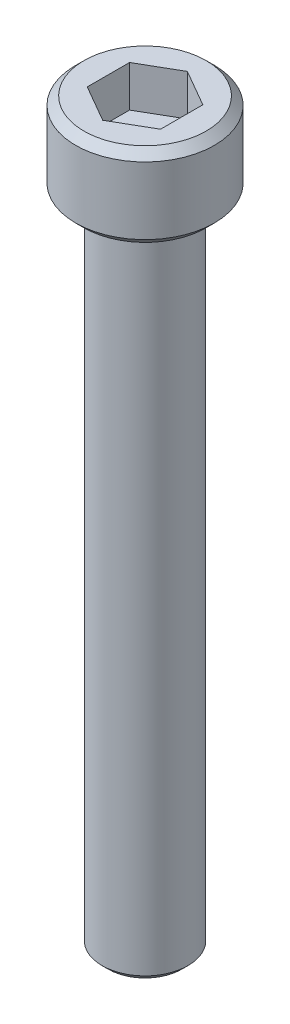
ISO-10303-21;
HEADER;
FILE_DESCRIPTION(('STEP AP214'),'2;1');
FILE_NAME('part.step','',(''),(''),'','','');
FILE_SCHEMA(('AUTOMOTIVE_DESIGN { 1 0 10303 214 1 1 1 1 }'));
ENDSEC;
DATA;
#1=APPLICATION_CONTEXT('core data for automotive mechanical design processes');
#2=APPLICATION_PROTOCOL_DEFINITION('international standard','automotive_design',2000,#1);
#3=PRODUCT_CONTEXT('',#1,'mechanical');
#4=PRODUCT('Part','Part','',(#3));
#5=PRODUCT_RELATED_PRODUCT_CATEGORY('part','',(#4));
#6=PRODUCT_DEFINITION_FORMATION('','',#4);
#7=PRODUCT_DEFINITION_CONTEXT('part definition',#1,'design');
#8=PRODUCT_DEFINITION('design','',#6,#7);
#9=PRODUCT_DEFINITION_SHAPE('','',#8);
#10=(LENGTH_UNIT() NAMED_UNIT(*) SI_UNIT(.MILLI.,.METRE.));
#11=(NAMED_UNIT(*) PLANE_ANGLE_UNIT() SI_UNIT($,.RADIAN.));
#12=(NAMED_UNIT(*) SI_UNIT($,.STERADIAN.) SOLID_ANGLE_UNIT());
#13=UNCERTAINTY_MEASURE_WITH_UNIT(LENGTH_MEASURE(1.E-05),#10,'distance_accuracy_value','');
#14=(GEOMETRIC_REPRESENTATION_CONTEXT(3) GLOBAL_UNCERTAINTY_ASSIGNED_CONTEXT((#13)) GLOBAL_UNIT_ASSIGNED_CONTEXT((#10,
#11,#12)) REPRESENTATION_CONTEXT('',''));
#15=CARTESIAN_POINT('',(0.,0.,0.));
#16=DIRECTION('',(0.,0.,1.));
#17=DIRECTION('',(1.,0.,0.));
#18=AXIS2_PLACEMENT_3D('',#15,#16,#17);
#19=CARTESIAN_POINT('',(1.77799999999999,2.064,3.07958633585744));
#20=DIRECTION('',(0.,1.,0.));
#21=DIRECTION('',(-1.,0.,0.));
#22=AXIS2_PLACEMENT_3D('',#19,#20,#21);
#23=PLANE('',#22);
#24=DIRECTION('',(-0.866025403784438,0.,0.5));
#25=VECTOR('',#24,1.);
#26=CARTESIAN_POINT('',(0.,2.064,-2.05305755723831));
#27=LINE('',#26,#25);
#28=CARTESIAN_POINT('',(0.,2.064,-2.05305755723831));
#29=VERTEX_POINT('',#28);
#30=CARTESIAN_POINT('',(-1.778,2.064,-1.02652877861915));
#31=VERTEX_POINT('',#30);
#32=EDGE_CURVE('E67',#29,#31,#27,.T.);
#33=ORIENTED_EDGE('',*,*,#32,.T.);
#34=DIRECTION('',(0.,0.,1.));
#35=VECTOR('',#34,1.);
#36=CARTESIAN_POINT('',(-1.778,2.064,-1.02652877861915));
#37=LINE('',#36,#35);
#38=CARTESIAN_POINT('',(-1.778,2.064,1.02652877861915));
#39=VERTEX_POINT('',#38);
#40=EDGE_CURVE('E69',#31,#39,#37,.T.);
#41=ORIENTED_EDGE('',*,*,#40,.T.);
#42=DIRECTION('',(0.866025403784439,0.,0.5));
#43=VECTOR('',#42,1.);
#44=CARTESIAN_POINT('',(-1.778,2.064,1.02652877861915));
#45=LINE('',#44,#43);
#46=CARTESIAN_POINT('',(0.,2.064,2.05305755723829));
#47=VERTEX_POINT('',#46);
#48=EDGE_CURVE('E71',#39,#47,#45,.T.);
#49=ORIENTED_EDGE('',*,*,#48,.T.);
#50=DIRECTION('',(0.866025403784438,0.,-0.500000000000001));
#51=VECTOR('',#50,1.);
#52=CARTESIAN_POINT('',(0.,2.064,2.05305755723828));
#53=LINE('',#52,#51);
#54=CARTESIAN_POINT('',(1.77799999999999,2.064,1.02652877861912));
#55=VERTEX_POINT('',#54);
#56=EDGE_CURVE('E126',#47,#55,#53,.T.);
#57=ORIENTED_EDGE('',*,*,#56,.T.);
#58=DIRECTION('',(0.,0.,1.));
#59=VECTOR('',#58,1.);
#60=CARTESIAN_POINT('',(1.77799999999999,2.064,1.02652877861912));
#61=LINE('',#60,#59);
#62=CARTESIAN_POINT('',(1.77799999999999,2.064,-1.02652877861916));
#63=VERTEX_POINT('',#62);
#64=EDGE_CURVE('E131',#55,#63,#61,.F.);
#65=ORIENTED_EDGE('',*,*,#64,.T.);
#66=DIRECTION('',(-0.866025403784439,0.,-0.5));
#67=VECTOR('',#66,1.);
#68=CARTESIAN_POINT('',(1.778,2.064,-1.02652877861916));
#69=LINE('',#68,#67);
#70=EDGE_CURVE('E135',#63,#29,#69,.T.);
#71=ORIENTED_EDGE('',*,*,#70,.T.);
#72=EDGE_LOOP('',(#33,#41,#49,#57,#65,#71));
#73=FACE_BOUND('',#72,.T.);
#74=ADVANCED_FACE('F16',(#73),#23,.T.);
#75=CARTESIAN_POINT('',(-1.778,2.064,1.02652877861915));
#76=DIRECTION('',(-0.5,0.,0.866025403784439));
#77=DIRECTION('',(0.866025403784439,0.,0.5));
#78=AXIS2_PLACEMENT_3D('',#75,#76,#77);
#79=PLANE('',#78);
#80=DIRECTION('',(0.,1.,0.));
#81=VECTOR('',#80,1.);
#82=CARTESIAN_POINT('',(0.,2.064,2.05305755723828));
#83=LINE('',#82,#81);
#84=CARTESIAN_POINT('',(0.,4.064,2.05305755723829));
#85=VERTEX_POINT('',#84);
#86=EDGE_CURVE('E82',#85,#47,#83,.F.);
#87=ORIENTED_EDGE('',*,*,#86,.T.);
#88=ORIENTED_EDGE('',*,*,#48,.F.);
#89=DIRECTION('',(0.,1.,0.));
#90=VECTOR('',#89,1.);
#91=CARTESIAN_POINT('',(-1.778,2.064,1.02652877861915));
#92=LINE('',#91,#90);
#93=CARTESIAN_POINT('',(-1.778,4.064,1.02652877861915));
#94=VERTEX_POINT('',#93);
#95=EDGE_CURVE('E76',#39,#94,#92,.T.);
#96=ORIENTED_EDGE('',*,*,#95,.T.);
#97=DIRECTION('',(-0.866025403784443,0.,-0.499999999999993));
#98=VECTOR('',#97,1.);
#99=CARTESIAN_POINT('',(0.,4.064,2.05305755723828));
#100=LINE('',#99,#98);
#101=EDGE_CURVE('E123',#85,#94,#100,.T.);
#102=ORIENTED_EDGE('',*,*,#101,.F.);
#103=EDGE_LOOP('',(#87,#88,#96,#102));
#104=FACE_BOUND('',#103,.T.);
#105=ADVANCED_FACE('F79',(#104),#79,.F.);
#106=CARTESIAN_POINT('',(-1.778,2.064,-1.02652877861915));
#107=DIRECTION('',(-1.,0.,0.));
#108=DIRECTION('',(0.,0.,1.));
#109=AXIS2_PLACEMENT_3D('',#106,#107,#108);
#110=PLANE('',#109);
#111=ORIENTED_EDGE('',*,*,#95,.F.);
#112=ORIENTED_EDGE('',*,*,#40,.F.);
#113=DIRECTION('',(0.,1.,0.));
#114=VECTOR('',#113,1.);
#115=CARTESIAN_POINT('',(-1.778,2.064,-1.02652877861916));
#116=LINE('',#115,#114);
#117=CARTESIAN_POINT('',(-1.778,4.064,-1.02652877861915));
#118=VERTEX_POINT('',#117);
#119=EDGE_CURVE('E90',#31,#118,#116,.T.);
#120=ORIENTED_EDGE('',*,*,#119,.T.);
#121=DIRECTION('',(0.,0.,1.));
#122=VECTOR('',#121,1.);
#123=CARTESIAN_POINT('',(-1.778,4.064,0.));
#124=LINE('',#123,#122);
#125=EDGE_CURVE('E87',#94,#118,#124,.F.);
#126=ORIENTED_EDGE('',*,*,#125,.F.);
#127=EDGE_LOOP('',(#111,#112,#120,#126));
#128=FACE_BOUND('',#127,.T.);
#129=ADVANCED_FACE('F85',(#128),#110,.F.);
#130=CARTESIAN_POINT('',(0.,2.064,-2.05305755723831));
#131=DIRECTION('',(-0.5,0.,-0.866025403784438));
#132=DIRECTION('',(-0.866025403784438,0.,0.5));
#133=AXIS2_PLACEMENT_3D('',#130,#131,#132);
#134=PLANE('',#133);
#135=ORIENTED_EDGE('',*,*,#119,.F.);
#136=ORIENTED_EDGE('',*,*,#32,.F.);
#137=DIRECTION('',(0.,1.,0.));
#138=VECTOR('',#137,1.);
#139=CARTESIAN_POINT('',(0.,2.064,-2.05305755723831));
#140=LINE('',#139,#138);
#141=CARTESIAN_POINT('',(0.,4.064,-2.05305755723831));
#142=VERTEX_POINT('',#141);
#143=EDGE_CURVE('E133',#29,#142,#140,.T.);
#144=ORIENTED_EDGE('',*,*,#143,.T.);
#145=DIRECTION('',(0.866025403784438,0.,-0.500000000000001));
#146=VECTOR('',#145,1.);
#147=CARTESIAN_POINT('',(-1.778,4.064,-1.02652877861915));
#148=LINE('',#147,#146);
#149=EDGE_CURVE('E119',#118,#142,#148,.T.);
#150=ORIENTED_EDGE('',*,*,#149,.F.);
#151=EDGE_LOOP('',(#135,#136,#144,#150));
#152=FACE_BOUND('',#151,.T.);
#153=ADVANCED_FACE('F138',(#152),#134,.F.);
#154=CARTESIAN_POINT('',(1.778,2.064,-1.02652877861916));
#155=DIRECTION('',(0.5,0.,-0.866025403784439));
#156=DIRECTION('',(-0.866025403784439,0.,-0.5));
#157=AXIS2_PLACEMENT_3D('',#154,#155,#156);
#158=PLANE('',#157);
#159=ORIENTED_EDGE('',*,*,#143,.F.);
#160=ORIENTED_EDGE('',*,*,#70,.F.);
#161=DIRECTION('',(0.,1.,0.));
#162=VECTOR('',#161,1.);
#163=CARTESIAN_POINT('',(1.77799999999999,2.064,-1.02652877861916));
#164=LINE('',#163,#162);
#165=CARTESIAN_POINT('',(1.77799999999999,4.064,-1.02652877861916));
#166=VERTEX_POINT('',#165);
#167=EDGE_CURVE('E129',#63,#166,#164,.T.);
#168=ORIENTED_EDGE('',*,*,#167,.T.);
#169=DIRECTION('',(0.86602540378444,0.,0.499999999999997));
#170=VECTOR('',#169,1.);
#171=CARTESIAN_POINT('',(0.,4.064,-2.05305755723831));
#172=LINE('',#171,#170);
#173=EDGE_CURVE('E116',#142,#166,#172,.T.);
#174=ORIENTED_EDGE('',*,*,#173,.F.);
#175=EDGE_LOOP('',(#159,#160,#168,#174));
#176=FACE_BOUND('',#175,.T.);
#177=ADVANCED_FACE('F150',(#176),#158,.F.);
#178=CARTESIAN_POINT('',(1.77799999999999,2.064,1.02652877861912));
#179=DIRECTION('',(1.,0.,0.));
#180=DIRECTION('',(0.,1.,0.));
#181=AXIS2_PLACEMENT_3D('',#178,#179,#180);
#182=PLANE('',#181);
#183=ORIENTED_EDGE('',*,*,#167,.F.);
#184=ORIENTED_EDGE('',*,*,#64,.F.);
#185=DIRECTION('',(0.,1.,0.));
#186=VECTOR('',#185,1.);
#187=CARTESIAN_POINT('',(1.77799999999999,2.064,1.02652877861912));
#188=LINE('',#187,#186);
#189=CARTESIAN_POINT('',(1.77799999999999,4.064,1.02652877861912));
#190=VERTEX_POINT('',#189);
#191=EDGE_CURVE('E34',#55,#190,#188,.T.);
#192=ORIENTED_EDGE('',*,*,#191,.T.);
#193=DIRECTION('',(0.,0.,1.));
#194=VECTOR('',#193,1.);
#195=CARTESIAN_POINT('',(1.778,4.064,0.));
#196=LINE('',#195,#194);
#197=EDGE_CURVE('E113',#166,#190,#196,.T.);
#198=ORIENTED_EDGE('',*,*,#197,.F.);
#199=EDGE_LOOP('',(#183,#184,#192,#198));
#200=FACE_BOUND('',#199,.T.);
#201=ADVANCED_FACE('F148',(#200),#182,.F.);
#202=CARTESIAN_POINT('',(0.,2.064,2.05305755723828));
#203=DIRECTION('',(0.500000000000001,0.,0.866025403784438));
#204=DIRECTION('',(0.866025403784438,0.,-0.500000000000001));
#205=AXIS2_PLACEMENT_3D('',#202,#203,#204);
#206=PLANE('',#205);
#207=ORIENTED_EDGE('',*,*,#191,.F.);
#208=ORIENTED_EDGE('',*,*,#56,.F.);
#209=ORIENTED_EDGE('',*,*,#86,.F.);
#210=DIRECTION('',(-0.866025403784437,0.,0.500000000000002));
#211=VECTOR('',#210,1.);
#212=CARTESIAN_POINT('',(1.77799999999999,4.064,1.02652877861912));
#213=LINE('',#212,#211);
#214=EDGE_CURVE('E110',#190,#85,#213,.T.);
#215=ORIENTED_EDGE('',*,*,#214,.F.);
#216=EDGE_LOOP('',(#207,#208,#209,#215));
#217=FACE_BOUND('',#216,.T.);
#218=ADVANCED_FACE('F145',(#217),#206,.F.);
#219=CARTESIAN_POINT('',(0.,4.064,0.));
#220=DIRECTION('',(0.,1.,0.));
#221=DIRECTION('',(-1.,0.,0.));
#222=AXIS2_PLACEMENT_3D('',#219,#220,#221);
#223=PLANE('',#222);
#224=ORIENTED_EDGE('',*,*,#197,.T.);
#225=ORIENTED_EDGE('',*,*,#214,.T.);
#226=ORIENTED_EDGE('',*,*,#101,.T.);
#227=ORIENTED_EDGE('',*,*,#125,.T.);
#228=ORIENTED_EDGE('',*,*,#149,.T.);
#229=ORIENTED_EDGE('',*,*,#173,.T.);
#230=EDGE_LOOP('',(#224,#225,#226,#227,#228,#229));
#231=FACE_BOUND('',#230,.T.);
#232=CARTESIAN_POINT('',(0.,4.06400000002805,0.));
#233=DIRECTION('',(0.,-1.,0.));
#234=DIRECTION('',(0.,0.,-1.));
#235=AXIS2_PLACEMENT_3D('',#232,#233,#234);
#236=CIRCLE('',#235,2.96550000001616);
#237=CARTESIAN_POINT('',(0.,4.06400000002805,-2.96550000001616));
#238=VERTEX_POINT('',#237);
#239=EDGE_CURVE('E19',#238,#238,#236,.T.);
#240=ORIENTED_EDGE('',*,*,#239,.F.);
#241=EDGE_LOOP('',(#240));
#242=FACE_BOUND('',#241,.T.);
#243=ADVANCED_FACE('F142',(#231,#242),#223,.T.);
#244=CARTESIAN_POINT('',(0.,3.6640000001853,0.));
#245=DIRECTION('',(0.,-1.,0.));
#246=DIRECTION('',(0.,0.,-1.));
#247=AXIS2_PLACEMENT_3D('',#244,#245,#246);
#248=CONICAL_SURFACE('',#247,3.36549999991576,0.785398163468503);
#249=ORIENTED_EDGE('',*,*,#239,.T.);
#250=EDGE_LOOP('',(#249));
#251=FACE_BOUND('',#250,.T.);
#252=CARTESIAN_POINT('',(0.,3.664,0.));
#253=DIRECTION('',(0.,-1.,0.));
#254=DIRECTION('',(1.,0.,0.));
#255=AXIS2_PLACEMENT_3D('',#252,#253,#254);
#256=CIRCLE('',#255,3.36549999999999);
#257=CARTESIAN_POINT('',(3.36549999999999,3.664,0.));
#258=VERTEX_POINT('',#257);
#259=EDGE_CURVE('E102',#258,#258,#256,.T.);
#260=ORIENTED_EDGE('',*,*,#259,.F.);
#261=EDGE_LOOP('',(#260));
#262=FACE_BOUND('',#261,.T.);
#263=ADVANCED_FACE('F187',(#251,#262),#248,.T.);
#264=CARTESIAN_POINT('',(0.,4.064,0.));
#265=DIRECTION('',(0.,-1.,0.));
#266=DIRECTION('',(1.,0.,0.));
#267=AXIS2_PLACEMENT_3D('',#264,#265,#266);
#268=CYLINDRICAL_SURFACE('',#267,3.36549999999999);
#269=ORIENTED_EDGE('',*,*,#259,.T.);
#270=EDGE_LOOP('',(#269));
#271=FACE_BOUND('',#270,.T.);
#272=CARTESIAN_POINT('',(0.,0.400000000013279,0.));
#273=DIRECTION('',(0.,1.,0.));
#274=DIRECTION('',(0.,0.,1.));
#275=AXIS2_PLACEMENT_3D('',#272,#273,#274);
#276=CIRCLE('',#275,3.36550000002944);
#277=CARTESIAN_POINT('',(0.,0.400000000013279,3.36550000002944));
#278=VERTEX_POINT('',#277);
#279=EDGE_CURVE('E98',#278,#278,#276,.F.);
#280=ORIENTED_EDGE('',*,*,#279,.F.);
#281=EDGE_LOOP('',(#280));
#282=FACE_BOUND('',#281,.T.);
#283=ADVANCED_FACE('F183',(#271,#282),#268,.T.);
#284=CARTESIAN_POINT('',(0.,-31.75,0.));
#285=DIRECTION('',(0.,1.,0.));
#286=DIRECTION('',(-1.,0.,0.));
#287=AXIS2_PLACEMENT_3D('',#284,#285,#286);
#288=PLANE('',#287);
#289=CARTESIAN_POINT('',(0.,-31.7499999999313,0.));
#290=DIRECTION('',(0.,1.,0.));
#291=DIRECTION('',(0.,0.,1.));
#292=AXIS2_PLACEMENT_3D('',#289,#290,#291);
#293=CIRCLE('',#292,1.78279999994402);
#294=CARTESIAN_POINT('',(0.,-31.7499999999313,1.78279999994402));
#295=VERTEX_POINT('',#294);
#296=EDGE_CURVE('E96',#295,#295,#293,.T.);
#297=ORIENTED_EDGE('',*,*,#296,.F.);
#298=EDGE_LOOP('',(#297));
#299=FACE_BOUND('',#298,.T.);
#300=ADVANCED_FACE('F179',(#299),#288,.F.);
#301=CARTESIAN_POINT('',(0.,0.400000000013279,0.));
#302=DIRECTION('',(0.,1.,0.));
#303=DIRECTION('',(0.,0.,1.));
#304=AXIS2_PLACEMENT_3D('',#301,#302,#303);
#305=CONICAL_SURFACE('',#304,3.36550000002944,0.785398163397448);
#306=CARTESIAN_POINT('',(0.,0.,0.));
#307=DIRECTION('',(0.,1.,0.));
#308=DIRECTION('',(0.,0.,1.));
#309=AXIS2_PLACEMENT_3D('',#306,#307,#308);
#310=CIRCLE('',#309,2.96550000001616);
#311=CARTESIAN_POINT('',(0.,0.,2.96550000001616));
#312=VERTEX_POINT('',#311);
#313=EDGE_CURVE('E94',#312,#312,#310,.T.);
#314=ORIENTED_EDGE('',*,*,#313,.T.);
#315=EDGE_LOOP('',(#314));
#316=FACE_BOUND('',#315,.T.);
#317=ORIENTED_EDGE('',*,*,#279,.T.);
#318=EDGE_LOOP('',(#317));
#319=FACE_BOUND('',#318,.T.);
#320=ADVANCED_FACE('F176',(#316,#319),#305,.T.);
#321=CARTESIAN_POINT('',(0.,-31.4500000000066,0.));
#322=DIRECTION('',(0.,1.,0.));
#323=DIRECTION('',(0.,0.,1.));
#324=AXIS2_PLACEMENT_3D('',#321,#322,#323);
#325=CONICAL_SURFACE('',#324,2.08279999992556,0.785398163492187);
#326=ORIENTED_EDGE('',*,*,#296,.T.);
#327=EDGE_LOOP('',(#326));
#328=FACE_BOUND('',#327,.T.);
#329=CARTESIAN_POINT('',(0.,-31.45,0.));
#330=DIRECTION('',(0.,1.,0.));
#331=DIRECTION('',(-1.,0.,0.));
#332=AXIS2_PLACEMENT_3D('',#329,#330,#331);
#333=CIRCLE('',#332,2.0828);
#334=CARTESIAN_POINT('',(-2.0828,-31.45,0.));
#335=VERTEX_POINT('',#334);
#336=EDGE_CURVE('E25',#335,#335,#333,.T.);
#337=ORIENTED_EDGE('',*,*,#336,.F.);
#338=EDGE_LOOP('',(#337));
#339=FACE_BOUND('',#338,.T.);
#340=ADVANCED_FACE('F168',(#328,#339),#325,.T.);
#341=CARTESIAN_POINT('',(0.,0.,0.));
#342=DIRECTION('',(0.,1.,0.));
#343=DIRECTION('',(-1.,0.,0.));
#344=AXIS2_PLACEMENT_3D('',#341,#342,#343);
#345=PLANE('',#344);
#346=CARTESIAN_POINT('',(0.,0.,0.));
#347=DIRECTION('',(0.,1.,0.));
#348=DIRECTION('',(-1.,0.,0.));
#349=AXIS2_PLACEMENT_3D('',#346,#347,#348);
#350=CIRCLE('',#349,2.0828);
#351=CARTESIAN_POINT('',(-2.0828,0.,0.));
#352=VERTEX_POINT('',#351);
#353=EDGE_CURVE('E11',#352,#352,#350,.F.);
#354=ORIENTED_EDGE('',*,*,#353,.F.);
#355=EDGE_LOOP('',(#354));
#356=FACE_BOUND('',#355,.T.);
#357=ORIENTED_EDGE('',*,*,#313,.F.);
#358=EDGE_LOOP('',(#357));
#359=FACE_BOUND('',#358,.T.);
#360=ADVANCED_FACE('F162',(#356,#359),#345,.F.);
#361=CARTESIAN_POINT('',(0.,-31.75,0.));
#362=DIRECTION('',(0.,1.,0.));
#363=DIRECTION('',(-1.,0.,0.));
#364=AXIS2_PLACEMENT_3D('',#361,#362,#363);
#365=CYLINDRICAL_SURFACE('',#364,2.0828);
#366=ORIENTED_EDGE('',*,*,#336,.T.);
#367=EDGE_LOOP('',(#366));
#368=FACE_BOUND('',#367,.T.);
#369=ORIENTED_EDGE('',*,*,#353,.T.);
#370=EDGE_LOOP('',(#369));
#371=FACE_BOUND('',#370,.T.);
#372=ADVANCED_FACE('F160',(#368,#371),#365,.T.);
#373=CLOSED_SHELL('',(#74,#105,#129,#153,#177,#201,#218,#243,#263,#283,#300,#320,#340,#360,#372));
#374=MANIFOLD_SOLID_BREP('B1',#373);
#375=ADVANCED_BREP_SHAPE_REPRESENTATION('',(#18,#374),#14);
#376=SHAPE_DEFINITION_REPRESENTATION(#9,#375);
ENDSEC;
END-ISO-10303-21;
